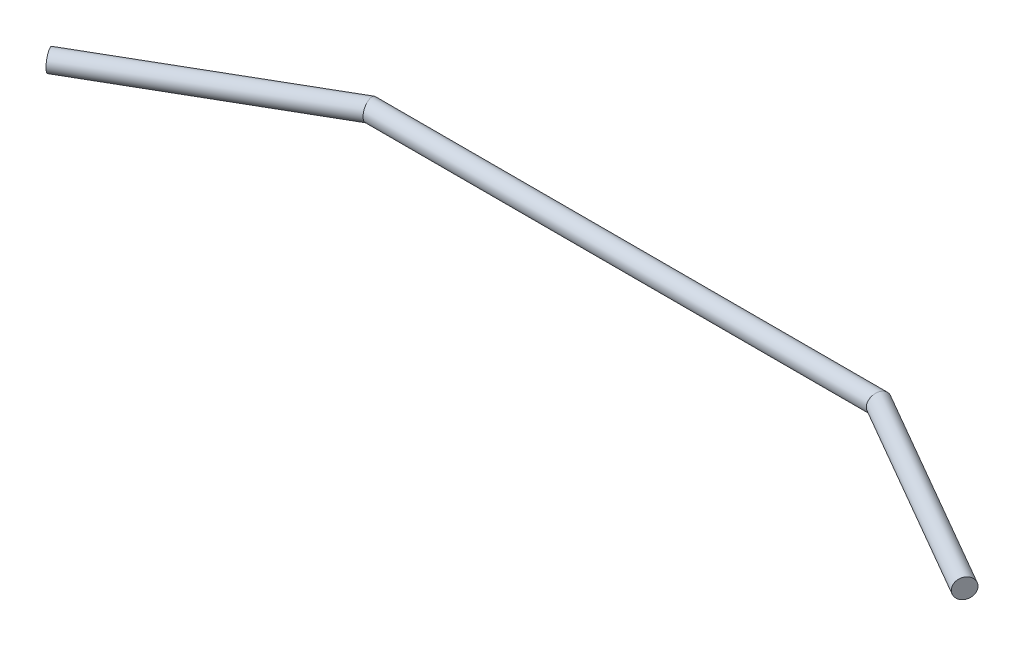
ISO-10303-21;
HEADER;
FILE_DESCRIPTION(('STEP AP214'),'2;1');
FILE_NAME('part.step','',(''),(''),'','','');
FILE_SCHEMA(('AUTOMOTIVE_DESIGN { 1 0 10303 214 1 1 1 1 }'));
ENDSEC;
DATA;
#1=APPLICATION_CONTEXT('core data for automotive mechanical design processes');
#2=APPLICATION_PROTOCOL_DEFINITION('international standard','automotive_design',2000,#1);
#3=PRODUCT_CONTEXT('',#1,'mechanical');
#4=PRODUCT('Part','Part','',(#3));
#5=PRODUCT_RELATED_PRODUCT_CATEGORY('part','',(#4));
#6=PRODUCT_DEFINITION_FORMATION('','',#4);
#7=PRODUCT_DEFINITION_CONTEXT('part definition',#1,'design');
#8=PRODUCT_DEFINITION('design','',#6,#7);
#9=PRODUCT_DEFINITION_SHAPE('','',#8);
#10=(LENGTH_UNIT() NAMED_UNIT(*) SI_UNIT(.MILLI.,.METRE.));
#11=(NAMED_UNIT(*) PLANE_ANGLE_UNIT() SI_UNIT($,.RADIAN.));
#12=(NAMED_UNIT(*) SI_UNIT($,.STERADIAN.) SOLID_ANGLE_UNIT());
#13=UNCERTAINTY_MEASURE_WITH_UNIT(LENGTH_MEASURE(1.E-05),#10,'distance_accuracy_value','');
#14=(GEOMETRIC_REPRESENTATION_CONTEXT(3) GLOBAL_UNCERTAINTY_ASSIGNED_CONTEXT((#13)) GLOBAL_UNIT_ASSIGNED_CONTEXT((#10,
#11,#12)) REPRESENTATION_CONTEXT('',''));
#15=CARTESIAN_POINT('',(0.,0.,0.));
#16=DIRECTION('',(0.,0.,1.));
#17=DIRECTION('',(1.,0.,0.));
#18=AXIS2_PLACEMENT_3D('',#15,#16,#17);
#19=CARTESIAN_POINT('',(58.4807621135332,0.,14.9999999999998));
#20=DIRECTION('',(0.866025403784442,0.,0.499999999999995));
#21=DIRECTION('',(0.499999999999995,0.,-0.866025403784442));
#22=AXIS2_PLACEMENT_3D('',#19,#20,#21);
#23=PLANE('',#22);
#24=CARTESIAN_POINT('',(58.4807621135332,0.,14.9999999999998));
#25=DIRECTION('',(0.866025403784442,0.,0.499999999999995));
#26=DIRECTION('',(0.499999999999995,0.,-0.866025403784442));
#27=AXIS2_PLACEMENT_3D('',#24,#25,#26);
#28=CIRCLE('',#27,1.25);
#29=CARTESIAN_POINT('',(59.1057621135332,0.,13.9174682452693));
#30=VERTEX_POINT('',#29);
#31=EDGE_CURVE('E50',#30,#30,#28,.T.);
#32=ORIENTED_EDGE('',*,*,#31,.T.);
#33=EDGE_LOOP('',(#32));
#34=FACE_BOUND('',#33,.T.);
#35=ADVANCED_FACE('F47',(#34),#23,.T.);
#36=CARTESIAN_POINT('',(-58.4807621135333,0.,14.9999999999999));
#37=DIRECTION('',(0.866025403784442,0.,-0.499999999999994));
#38=DIRECTION('',(-0.499999999999994,0.,-0.866025403784442));
#39=AXIS2_PLACEMENT_3D('',#36,#37,#38);
#40=PLANE('',#39);
#41=CARTESIAN_POINT('',(-58.4807621135333,0.,14.9999999999999));
#42=DIRECTION('',(0.866025403784442,0.,-0.499999999999994));
#43=DIRECTION('',(-0.499999999999994,0.,-0.866025403784442));
#44=AXIS2_PLACEMENT_3D('',#41,#42,#43);
#45=CIRCLE('',#44,1.25);
#46=CARTESIAN_POINT('',(-59.1057621135333,0.,13.9174682452693));
#47=VERTEX_POINT('',#46);
#48=EDGE_CURVE('E55',#47,#47,#45,.T.);
#49=ORIENTED_EDGE('',*,*,#48,.F.);
#50=EDGE_LOOP('',(#49));
#51=FACE_BOUND('',#50,.T.);
#52=ADVANCED_FACE('F75',(#51),#40,.F.);
#53=CARTESIAN_POINT('',(32.0943275992144,0.,-0.23421506979638));
#54=DIRECTION('',(0.866025403784442,0.,0.499999999999995));
#55=DIRECTION('',(0.499999999999995,0.,-0.866025403784442));
#56=AXIS2_PLACEMENT_3D('',#53,#54,#55);
#57=CYLINDRICAL_SURFACE('',#56,1.25);
#58=CARTESIAN_POINT('',(32.5,0.,0.));
#59=DIRECTION('',(0.965925826289069,0.,0.258819045102518));
#60=DIRECTION('',(0.258819045102518,0.,-0.965925826289069));
#61=AXIS2_PLACEMENT_3D('',#58,#59,#60);
#62=ELLIPSE('',#61,1.2940952255126,1.25);
#63=CARTESIAN_POINT('',(32.8349364905389,0.,-1.24999999999999));
#64=VERTEX_POINT('',#63);
#65=EDGE_CURVE('E61',#64,#64,#62,.F.);
#66=ORIENTED_EDGE('',*,*,#65,.F.);
#67=EDGE_LOOP('',(#66));
#68=FACE_BOUND('',#67,.T.);
#69=ORIENTED_EDGE('',*,*,#31,.F.);
#70=EDGE_LOOP('',(#69));
#71=FACE_BOUND('',#70,.T.);
#72=ADVANCED_FACE('F72',(#68,#71),#57,.T.);
#73=CARTESIAN_POINT('',(-32.9684301395928,0.,0.));
#74=DIRECTION('',(1.,0.,0.));
#75=DIRECTION('',(0.,0.,-1.));
#76=AXIS2_PLACEMENT_3D('',#73,#74,#75);
#77=CYLINDRICAL_SURFACE('',#76,1.25);
#78=CARTESIAN_POINT('',(-32.5,0.,0.));
#79=DIRECTION('',(0.965925826289069,0.,-0.258819045102518));
#80=DIRECTION('',(-0.258819045102518,0.,-0.965925826289069));
#81=AXIS2_PLACEMENT_3D('',#78,#79,#80);
#82=ELLIPSE('',#81,1.2940952255126,1.25);
#83=CARTESIAN_POINT('',(-32.8349364905389,0.,-1.24999999999999));
#84=VERTEX_POINT('',#83);
#85=EDGE_CURVE('E11',#84,#84,#82,.F.);
#86=ORIENTED_EDGE('',*,*,#85,.F.);
#87=EDGE_LOOP('',(#86));
#88=FACE_BOUND('',#87,.T.);
#89=ORIENTED_EDGE('',*,*,#65,.T.);
#90=EDGE_LOOP('',(#89));
#91=FACE_BOUND('',#90,.T.);
#92=ADVANCED_FACE('F74',(#88,#91),#77,.T.);
#93=CARTESIAN_POINT('',(-58.4807621135333,0.,14.9999999999999));
#94=DIRECTION('',(0.866025403784442,0.,-0.499999999999995));
#95=DIRECTION('',(-0.499999999999995,0.,-0.866025403784442));
#96=AXIS2_PLACEMENT_3D('',#93,#94,#95);
#97=CYLINDRICAL_SURFACE('',#96,1.25);
#98=ORIENTED_EDGE('',*,*,#48,.T.);
#99=EDGE_LOOP('',(#98));
#100=FACE_BOUND('',#99,.T.);
#101=ORIENTED_EDGE('',*,*,#85,.T.);
#102=EDGE_LOOP('',(#101));
#103=FACE_BOUND('',#102,.T.);
#104=ADVANCED_FACE('F82',(#100,#103),#97,.T.);
#105=CLOSED_SHELL('',(#35,#52,#72,#92,#104));
#106=MANIFOLD_SOLID_BREP('B2',#105);
#107=ADVANCED_BREP_SHAPE_REPRESENTATION('',(#18,#106),#14);
#108=SHAPE_DEFINITION_REPRESENTATION(#9,#107);
ENDSEC;
END-ISO-10303-21;
